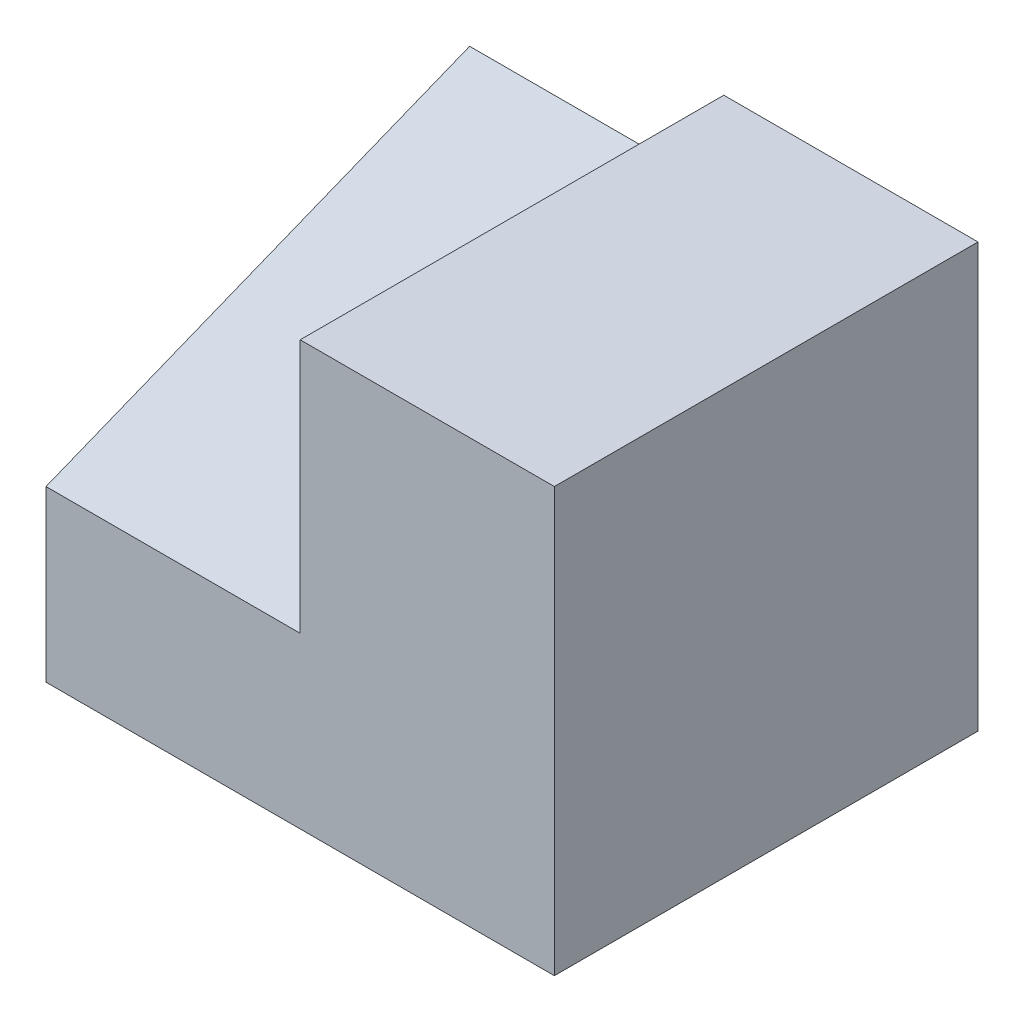
ISO-10303-21;
HEADER;
FILE_DESCRIPTION(('STEP AP214'),'2;1');
FILE_NAME('part.step','',(''),(''),'','','');
FILE_SCHEMA(('AUTOMOTIVE_DESIGN { 1 0 10303 214 1 1 1 1 }'));
ENDSEC;
DATA;
#1=APPLICATION_CONTEXT('core data for automotive mechanical design processes');
#2=APPLICATION_PROTOCOL_DEFINITION('international standard','automotive_design',2000,#1);
#3=PRODUCT_CONTEXT('',#1,'mechanical');
#4=PRODUCT('Part','Part','',(#3));
#5=PRODUCT_RELATED_PRODUCT_CATEGORY('part','',(#4));
#6=PRODUCT_DEFINITION_FORMATION('','',#4);
#7=PRODUCT_DEFINITION_CONTEXT('part definition',#1,'design');
#8=PRODUCT_DEFINITION('design','',#6,#7);
#9=PRODUCT_DEFINITION_SHAPE('','',#8);
#10=(LENGTH_UNIT() NAMED_UNIT(*) SI_UNIT(.MILLI.,.METRE.));
#11=(NAMED_UNIT(*) PLANE_ANGLE_UNIT() SI_UNIT($,.RADIAN.));
#12=(NAMED_UNIT(*) SI_UNIT($,.STERADIAN.) SOLID_ANGLE_UNIT());
#13=UNCERTAINTY_MEASURE_WITH_UNIT(LENGTH_MEASURE(1.E-05),#10,'distance_accuracy_value','');
#14=(GEOMETRIC_REPRESENTATION_CONTEXT(3) GLOBAL_UNCERTAINTY_ASSIGNED_CONTEXT((#13)) GLOBAL_UNIT_ASSIGNED_CONTEXT((#10,
#11,#12)) REPRESENTATION_CONTEXT('',''));
#15=CARTESIAN_POINT('',(0.,0.,0.));
#16=DIRECTION('',(0.,0.,1.));
#17=DIRECTION('',(1.,0.,0.));
#18=AXIS2_PLACEMENT_3D('',#15,#16,#17);
#19=CARTESIAN_POINT('',(-15.,10.,25.));
#20=DIRECTION('',(1.,0.,0.));
#21=DIRECTION('',(0.,1.,0.));
#22=AXIS2_PLACEMENT_3D('',#19,#20,#21);
#23=PLANE('',#22);
#24=DIRECTION('',(0.,0.371390676354104,-0.928476690885259));
#25=VECTOR('',#24,1.);
#26=CARTESIAN_POINT('',(-15.,20.,0.));
#27=LINE('',#26,#25);
#28=CARTESIAN_POINT('',(-15.,10.,25.));
#29=VERTEX_POINT('',#28);
#30=CARTESIAN_POINT('',(-15.,20.,0.));
#31=VERTEX_POINT('',#30);
#32=EDGE_CURVE('E81',#29,#31,#27,.T.);
#33=ORIENTED_EDGE('',*,*,#32,.F.);
#34=DIRECTION('',(0.,-1.,0.));
#35=VECTOR('',#34,1.);
#36=CARTESIAN_POINT('',(-15.,10.,25.));
#37=LINE('',#36,#35);
#38=CARTESIAN_POINT('',(-15.,25.,25.));
#39=VERTEX_POINT('',#38);
#40=EDGE_CURVE('E122',#39,#29,#37,.T.);
#41=ORIENTED_EDGE('',*,*,#40,.F.);
#42=DIRECTION('',(0.,0.,-1.));
#43=VECTOR('',#42,1.);
#44=CARTESIAN_POINT('',(-15.,25.,25.));
#45=LINE('',#44,#43);
#46=CARTESIAN_POINT('',(-15.,25.,0.));
#47=VERTEX_POINT('',#46);
#48=EDGE_CURVE('E110',#39,#47,#45,.T.);
#49=ORIENTED_EDGE('',*,*,#48,.T.);
#50=DIRECTION('',(0.,-1.,0.));
#51=VECTOR('',#50,1.);
#52=CARTESIAN_POINT('',(-15.,10.,0.));
#53=LINE('',#52,#51);
#54=EDGE_CURVE('E47',#47,#31,#53,.T.);
#55=ORIENTED_EDGE('',*,*,#54,.T.);
#56=EDGE_LOOP('',(#33,#41,#49,#55));
#57=FACE_BOUND('',#56,.T.);
#58=ADVANCED_FACE('F33',(#57),#23,.F.);
#59=CARTESIAN_POINT('',(-30.,0.,25.));
#60=DIRECTION('',(1.,0.,0.));
#61=DIRECTION('',(0.,0.,-1.));
#62=AXIS2_PLACEMENT_3D('',#59,#60,#61);
#63=PLANE('',#62);
#64=DIRECTION('',(0.,-1.,0.));
#65=VECTOR('',#64,1.);
#66=CARTESIAN_POINT('',(-30.,0.,0.));
#67=LINE('',#66,#65);
#68=CARTESIAN_POINT('',(-30.,20.,0.));
#69=VERTEX_POINT('',#68);
#70=CARTESIAN_POINT('',(-30.,0.,0.));
#71=VERTEX_POINT('',#70);
#72=EDGE_CURVE('E115',#69,#71,#67,.T.);
#73=ORIENTED_EDGE('',*,*,#72,.T.);
#74=DIRECTION('',(0.,0.,-1.));
#75=VECTOR('',#74,1.);
#76=CARTESIAN_POINT('',(-30.,0.,25.));
#77=LINE('',#76,#75);
#78=CARTESIAN_POINT('',(-30.,0.,25.));
#79=VERTEX_POINT('',#78);
#80=EDGE_CURVE('E11',#79,#71,#77,.T.);
#81=ORIENTED_EDGE('',*,*,#80,.F.);
#82=DIRECTION('',(0.,-1.,0.));
#83=VECTOR('',#82,1.);
#84=CARTESIAN_POINT('',(-30.,0.,25.));
#85=LINE('',#84,#83);
#86=CARTESIAN_POINT('',(-30.,10.,25.));
#87=VERTEX_POINT('',#86);
#88=EDGE_CURVE('E97',#87,#79,#85,.T.);
#89=ORIENTED_EDGE('',*,*,#88,.F.);
#90=DIRECTION('',(0.,0.371390676354104,-0.928476690885259));
#91=VECTOR('',#90,1.);
#92=CARTESIAN_POINT('',(-30.,20.,0.));
#93=LINE('',#92,#91);
#94=EDGE_CURVE('E133',#87,#69,#93,.T.);
#95=ORIENTED_EDGE('',*,*,#94,.T.);
#96=EDGE_LOOP('',(#73,#81,#89,#95));
#97=FACE_BOUND('',#96,.T.);
#98=ADVANCED_FACE('F142',(#97),#63,.F.);
#99=CARTESIAN_POINT('',(0.,0.,25.));
#100=DIRECTION('',(0.,1.,0.));
#101=DIRECTION('',(-1.,0.,0.));
#102=AXIS2_PLACEMENT_3D('',#99,#100,#101);
#103=PLANE('',#102);
#104=DIRECTION('',(1.,0.,0.));
#105=VECTOR('',#104,1.);
#106=CARTESIAN_POINT('',(0.,0.,0.));
#107=LINE('',#106,#105);
#108=CARTESIAN_POINT('',(0.,0.,0.));
#109=VERTEX_POINT('',#108);
#110=EDGE_CURVE('E104',#71,#109,#107,.T.);
#111=ORIENTED_EDGE('',*,*,#110,.T.);
#112=DIRECTION('',(0.,0.,-1.));
#113=VECTOR('',#112,1.);
#114=CARTESIAN_POINT('',(0.,0.,25.));
#115=LINE('',#114,#113);
#116=CARTESIAN_POINT('',(0.,0.,25.));
#117=VERTEX_POINT('',#116);
#118=EDGE_CURVE('E40',#117,#109,#115,.T.);
#119=ORIENTED_EDGE('',*,*,#118,.F.);
#120=DIRECTION('',(1.,0.,0.));
#121=VECTOR('',#120,1.);
#122=CARTESIAN_POINT('',(0.,0.,25.));
#123=LINE('',#122,#121);
#124=EDGE_CURVE('E90',#79,#117,#123,.T.);
#125=ORIENTED_EDGE('',*,*,#124,.F.);
#126=ORIENTED_EDGE('',*,*,#80,.T.);
#127=EDGE_LOOP('',(#111,#119,#125,#126));
#128=FACE_BOUND('',#127,.T.);
#129=ADVANCED_FACE('F102',(#128),#103,.F.);
#130=CARTESIAN_POINT('',(0.,25.,25.));
#131=DIRECTION('',(-1.,0.,0.));
#132=DIRECTION('',(0.,-1.,0.));
#133=AXIS2_PLACEMENT_3D('',#130,#131,#132);
#134=PLANE('',#133);
#135=DIRECTION('',(0.,1.,0.));
#136=VECTOR('',#135,1.);
#137=CARTESIAN_POINT('',(0.,25.,0.));
#138=LINE('',#137,#136);
#139=CARTESIAN_POINT('',(0.,25.,0.));
#140=VERTEX_POINT('',#139);
#141=EDGE_CURVE('E119',#109,#140,#138,.T.);
#142=ORIENTED_EDGE('',*,*,#141,.T.);
#143=DIRECTION('',(0.,0.,-1.));
#144=VECTOR('',#143,1.);
#145=CARTESIAN_POINT('',(0.,25.,25.));
#146=LINE('',#145,#144);
#147=CARTESIAN_POINT('',(0.,25.,25.));
#148=VERTEX_POINT('',#147);
#149=EDGE_CURVE('E107',#148,#140,#146,.T.);
#150=ORIENTED_EDGE('',*,*,#149,.F.);
#151=DIRECTION('',(0.,1.,0.));
#152=VECTOR('',#151,1.);
#153=CARTESIAN_POINT('',(0.,25.,25.));
#154=LINE('',#153,#152);
#155=EDGE_CURVE('E94',#117,#148,#154,.T.);
#156=ORIENTED_EDGE('',*,*,#155,.F.);
#157=ORIENTED_EDGE('',*,*,#118,.T.);
#158=EDGE_LOOP('',(#142,#150,#156,#157));
#159=FACE_BOUND('',#158,.T.);
#160=ADVANCED_FACE('F108',(#159),#134,.F.);
#161=CARTESIAN_POINT('',(-15.,25.,25.));
#162=DIRECTION('',(0.,-1.,0.));
#163=DIRECTION('',(0.,0.,-1.));
#164=AXIS2_PLACEMENT_3D('',#161,#162,#163);
#165=PLANE('',#164);
#166=DIRECTION('',(-1.,0.,0.));
#167=VECTOR('',#166,1.);
#168=CARTESIAN_POINT('',(-15.,25.,0.));
#169=LINE('',#168,#167);
#170=EDGE_CURVE('E77',#140,#47,#169,.T.);
#171=ORIENTED_EDGE('',*,*,#170,.T.);
#172=ORIENTED_EDGE('',*,*,#48,.F.);
#173=DIRECTION('',(-1.,0.,0.));
#174=VECTOR('',#173,1.);
#175=CARTESIAN_POINT('',(-15.,25.,25.));
#176=LINE('',#175,#174);
#177=EDGE_CURVE('E56',#148,#39,#176,.T.);
#178=ORIENTED_EDGE('',*,*,#177,.F.);
#179=ORIENTED_EDGE('',*,*,#149,.T.);
#180=EDGE_LOOP('',(#171,#172,#178,#179));
#181=FACE_BOUND('',#180,.T.);
#182=ADVANCED_FACE('F124',(#181),#165,.F.);
#183=CARTESIAN_POINT('',(0.,0.,25.));
#184=DIRECTION('',(0.,0.,-1.));
#185=DIRECTION('',(-1.,0.,0.));
#186=AXIS2_PLACEMENT_3D('',#183,#184,#185);
#187=PLANE('',#186);
#188=ORIENTED_EDGE('',*,*,#40,.T.);
#189=DIRECTION('',(-1.,0.,0.));
#190=VECTOR('',#189,1.);
#191=CARTESIAN_POINT('',(-30.,10.,25.));
#192=LINE('',#191,#190);
#193=EDGE_CURVE('E139',#29,#87,#192,.T.);
#194=ORIENTED_EDGE('',*,*,#193,.T.);
#195=ORIENTED_EDGE('',*,*,#88,.T.);
#196=ORIENTED_EDGE('',*,*,#124,.T.);
#197=ORIENTED_EDGE('',*,*,#155,.T.);
#198=ORIENTED_EDGE('',*,*,#177,.T.);
#199=EDGE_LOOP('',(#188,#194,#195,#196,#197,#198));
#200=FACE_BOUND('',#199,.T.);
#201=ADVANCED_FACE('F92',(#200),#187,.F.);
#202=CARTESIAN_POINT('',(0.,0.,0.));
#203=DIRECTION('',(0.,0.,-1.));
#204=DIRECTION('',(-1.,0.,0.));
#205=AXIS2_PLACEMENT_3D('',#202,#203,#204);
#206=PLANE('',#205);
#207=ORIENTED_EDGE('',*,*,#72,.F.);
#208=DIRECTION('',(1.,0.,0.));
#209=VECTOR('',#208,1.);
#210=CARTESIAN_POINT('',(-30.,20.,0.));
#211=LINE('',#210,#209);
#212=EDGE_CURVE('E116',#69,#31,#211,.T.);
#213=ORIENTED_EDGE('',*,*,#212,.T.);
#214=ORIENTED_EDGE('',*,*,#54,.F.);
#215=ORIENTED_EDGE('',*,*,#170,.F.);
#216=ORIENTED_EDGE('',*,*,#141,.F.);
#217=ORIENTED_EDGE('',*,*,#110,.F.);
#218=EDGE_LOOP('',(#207,#213,#214,#215,#216,#217));
#219=FACE_BOUND('',#218,.T.);
#220=ADVANCED_FACE('F127',(#219),#206,.T.);
#221=CARTESIAN_POINT('',(-30.,20.,0.));
#222=DIRECTION('',(0.,-0.928476690885259,-0.371390676354104));
#223=DIRECTION('',(0.,0.371390676354104,-0.928476690885259));
#224=AXIS2_PLACEMENT_3D('',#221,#222,#223);
#225=PLANE('',#224);
#226=ORIENTED_EDGE('',*,*,#32,.T.);
#227=ORIENTED_EDGE('',*,*,#212,.F.);
#228=ORIENTED_EDGE('',*,*,#94,.F.);
#229=ORIENTED_EDGE('',*,*,#193,.F.);
#230=EDGE_LOOP('',(#226,#227,#228,#229));
#231=FACE_BOUND('',#230,.T.);
#232=ADVANCED_FACE('F143',(#231),#225,.F.);
#233=CLOSED_SHELL('',(#58,#98,#129,#160,#182,#201,#220,#232));
#234=MANIFOLD_SOLID_BREP('B2',#233);
#235=ADVANCED_BREP_SHAPE_REPRESENTATION('',(#18,#234),#14);
#236=SHAPE_DEFINITION_REPRESENTATION(#9,#235);
ENDSEC;
END-ISO-10303-21;
